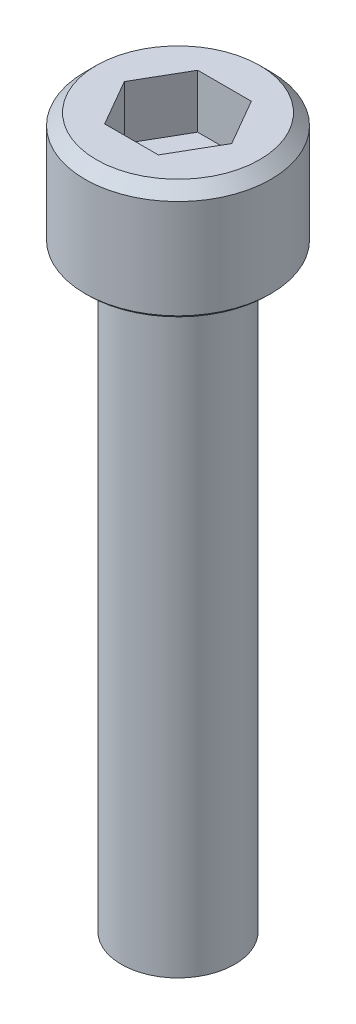
ISO-10303-21;
HEADER;
FILE_DESCRIPTION(('STEP AP214'),'2;1');
FILE_NAME('part.step','',(''),(''),'','','');
FILE_SCHEMA(('AUTOMOTIVE_DESIGN { 1 0 10303 214 1 1 1 1 }'));
ENDSEC;
DATA;
#1=APPLICATION_CONTEXT('core data for automotive mechanical design processes');
#2=APPLICATION_PROTOCOL_DEFINITION('international standard','automotive_design',2000,#1);
#3=PRODUCT_CONTEXT('',#1,'mechanical');
#4=PRODUCT('Part','Part','',(#3));
#5=PRODUCT_RELATED_PRODUCT_CATEGORY('part','',(#4));
#6=PRODUCT_DEFINITION_FORMATION('','',#4);
#7=PRODUCT_DEFINITION_CONTEXT('part definition',#1,'design');
#8=PRODUCT_DEFINITION('design','',#6,#7);
#9=PRODUCT_DEFINITION_SHAPE('','',#8);
#10=(LENGTH_UNIT() NAMED_UNIT(*) SI_UNIT(.MILLI.,.METRE.));
#11=(NAMED_UNIT(*) PLANE_ANGLE_UNIT() SI_UNIT($,.RADIAN.));
#12=(NAMED_UNIT(*) SI_UNIT($,.STERADIAN.) SOLID_ANGLE_UNIT());
#13=UNCERTAINTY_MEASURE_WITH_UNIT(LENGTH_MEASURE(1.E-05),#10,'distance_accuracy_value','');
#14=(GEOMETRIC_REPRESENTATION_CONTEXT(3) GLOBAL_UNCERTAINTY_ASSIGNED_CONTEXT((#13)) GLOBAL_UNIT_ASSIGNED_CONTEXT((#10,
#11,#12)) REPRESENTATION_CONTEXT('',''));
#15=CARTESIAN_POINT('',(0.,0.,0.));
#16=DIRECTION('',(0.,0.,1.));
#17=DIRECTION('',(1.,0.,0.));
#18=AXIS2_PLACEMENT_3D('',#15,#16,#17);
#19=CARTESIAN_POINT('',(-1.14384635331849,27.94,1.9812));
#20=DIRECTION('',(0.,-1.,0.));
#21=DIRECTION('',(0.,0.,-1.));
#22=AXIS2_PLACEMENT_3D('',#19,#20,#21);
#23=PLANE('',#22);
#24=DIRECTION('',(0.500000000000001,0.,-0.866025403784438));
#25=VECTOR('',#24,1.);
#26=CARTESIAN_POINT('',(1.14384635331849,27.94,1.9812));
#27=LINE('',#26,#25);
#28=CARTESIAN_POINT('',(1.14384635331849,27.94,1.9812));
#29=VERTEX_POINT('',#28);
#30=CARTESIAN_POINT('',(2.28769270663697,27.94,0.));
#31=VERTEX_POINT('',#30);
#32=EDGE_CURVE('E64',#29,#31,#27,.T.);
#33=ORIENTED_EDGE('',*,*,#32,.T.);
#34=DIRECTION('',(-0.5,0.,-0.866025403784439));
#35=VECTOR('',#34,1.);
#36=CARTESIAN_POINT('',(2.28769270663697,27.94,0.));
#37=LINE('',#36,#35);
#38=CARTESIAN_POINT('',(1.14384635331849,27.94,-1.9812));
#39=VERTEX_POINT('',#38);
#40=EDGE_CURVE('E102',#31,#39,#37,.T.);
#41=ORIENTED_EDGE('',*,*,#40,.T.);
#42=DIRECTION('',(-1.,0.,0.));
#43=VECTOR('',#42,1.);
#44=CARTESIAN_POINT('',(1.14384635331849,27.94,-1.9812));
#45=LINE('',#44,#43);
#46=CARTESIAN_POINT('',(-1.14384635331849,27.94,-1.9812));
#47=VERTEX_POINT('',#46);
#48=EDGE_CURVE('E98',#39,#47,#45,.T.);
#49=ORIENTED_EDGE('',*,*,#48,.T.);
#50=DIRECTION('',(-0.5,0.,0.866025403784439));
#51=VECTOR('',#50,1.);
#52=CARTESIAN_POINT('',(-1.14384635331849,27.94,-1.9812));
#53=LINE('',#52,#51);
#54=CARTESIAN_POINT('',(-2.28769270663697,27.94,0.));
#55=VERTEX_POINT('',#54);
#56=EDGE_CURVE('E81',#47,#55,#53,.T.);
#57=ORIENTED_EDGE('',*,*,#56,.T.);
#58=DIRECTION('',(0.5,0.,0.866025403784439));
#59=VECTOR('',#58,1.);
#60=CARTESIAN_POINT('',(-2.28769270663697,27.94,0.));
#61=LINE('',#60,#59);
#62=CARTESIAN_POINT('',(-1.14384635331849,27.94,1.9812));
#63=VERTEX_POINT('',#62);
#64=EDGE_CURVE('E77',#55,#63,#61,.T.);
#65=ORIENTED_EDGE('',*,*,#64,.T.);
#66=DIRECTION('',(1.,0.,0.));
#67=VECTOR('',#66,1.);
#68=CARTESIAN_POINT('',(-1.14384635331849,27.94,1.9812));
#69=LINE('',#68,#67);
#70=EDGE_CURVE('E79',#63,#29,#69,.T.);
#71=ORIENTED_EDGE('',*,*,#70,.T.);
#72=EDGE_LOOP('',(#33,#41,#49,#57,#65,#71));
#73=FACE_BOUND('',#72,.T.);
#74=ADVANCED_FACE('F18',(#73),#23,.F.);
#75=CARTESIAN_POINT('',(-1.14384635331849,27.94,1.9812));
#76=DIRECTION('',(0.,0.,1.));
#77=DIRECTION('',(1.,0.,0.));
#78=AXIS2_PLACEMENT_3D('',#75,#76,#77);
#79=PLANE('',#78);
#80=DIRECTION('',(0.,1.,0.));
#81=VECTOR('',#80,1.);
#82=CARTESIAN_POINT('',(1.14384635331849,27.94,1.9812));
#83=LINE('',#82,#81);
#84=CARTESIAN_POINT('',(1.14384635331849,30.226,1.9812));
#85=VERTEX_POINT('',#84);
#86=EDGE_CURVE('E89',#85,#29,#83,.F.);
#87=ORIENTED_EDGE('',*,*,#86,.T.);
#88=ORIENTED_EDGE('',*,*,#70,.F.);
#89=DIRECTION('',(0.,1.,0.));
#90=VECTOR('',#89,1.);
#91=CARTESIAN_POINT('',(-1.14384635331849,27.94,1.9812));
#92=LINE('',#91,#90);
#93=CARTESIAN_POINT('',(-1.14384635331849,30.226,1.9812));
#94=VERTEX_POINT('',#93);
#95=EDGE_CURVE('E85',#63,#94,#92,.T.);
#96=ORIENTED_EDGE('',*,*,#95,.T.);
#97=DIRECTION('',(1.,0.,0.));
#98=VECTOR('',#97,1.);
#99=CARTESIAN_POINT('',(3.9624,30.226,1.9812));
#100=LINE('',#99,#98);
#101=EDGE_CURVE('E57',#85,#94,#100,.F.);
#102=ORIENTED_EDGE('',*,*,#101,.F.);
#103=EDGE_LOOP('',(#87,#88,#96,#102));
#104=FACE_BOUND('',#103,.T.);
#105=ADVANCED_FACE('F87',(#104),#79,.F.);
#106=CARTESIAN_POINT('',(-2.28769270663697,27.94,0.));
#107=DIRECTION('',(-0.866025403784439,0.,0.5));
#108=DIRECTION('',(0.5,0.,0.866025403784439));
#109=AXIS2_PLACEMENT_3D('',#106,#107,#108);
#110=PLANE('',#109);
#111=ORIENTED_EDGE('',*,*,#95,.F.);
#112=ORIENTED_EDGE('',*,*,#64,.F.);
#113=DIRECTION('',(0.,1.,0.));
#114=VECTOR('',#113,1.);
#115=CARTESIAN_POINT('',(-2.28769270663697,27.94,0.));
#116=LINE('',#115,#114);
#117=CARTESIAN_POINT('',(-2.28769270663697,30.226,0.));
#118=VERTEX_POINT('',#117);
#119=EDGE_CURVE('E95',#55,#118,#116,.T.);
#120=ORIENTED_EDGE('',*,*,#119,.T.);
#121=DIRECTION('',(-0.5,0.,-0.866025403784439));
#122=VECTOR('',#121,1.);
#123=CARTESIAN_POINT('',(-1.14384635331849,30.226,1.9812));
#124=LINE('',#123,#122);
#125=EDGE_CURVE('E93',#94,#118,#124,.T.);
#126=ORIENTED_EDGE('',*,*,#125,.F.);
#127=EDGE_LOOP('',(#111,#112,#120,#126));
#128=FACE_BOUND('',#127,.T.);
#129=ADVANCED_FACE('F91',(#128),#110,.F.);
#130=CARTESIAN_POINT('',(-1.14384635331849,27.94,-1.9812));
#131=DIRECTION('',(-0.866025403784439,0.,-0.5));
#132=DIRECTION('',(-0.5,0.,0.866025403784439));
#133=AXIS2_PLACEMENT_3D('',#130,#131,#132);
#134=PLANE('',#133);
#135=ORIENTED_EDGE('',*,*,#119,.F.);
#136=ORIENTED_EDGE('',*,*,#56,.F.);
#137=DIRECTION('',(0.,1.,0.));
#138=VECTOR('',#137,1.);
#139=CARTESIAN_POINT('',(-1.14384635331849,27.94,-1.9812));
#140=LINE('',#139,#138);
#141=CARTESIAN_POINT('',(-1.14384635331849,30.226,-1.9812));
#142=VERTEX_POINT('',#141);
#143=EDGE_CURVE('E100',#47,#142,#140,.T.);
#144=ORIENTED_EDGE('',*,*,#143,.T.);
#145=DIRECTION('',(0.5,0.,-0.866025403784439));
#146=VECTOR('',#145,1.);
#147=CARTESIAN_POINT('',(-2.28769270663697,30.226,0.));
#148=LINE('',#147,#146);
#149=EDGE_CURVE('E119',#118,#142,#148,.T.);
#150=ORIENTED_EDGE('',*,*,#149,.F.);
#151=EDGE_LOOP('',(#135,#136,#144,#150));
#152=FACE_BOUND('',#151,.T.);
#153=ADVANCED_FACE('F185',(#152),#134,.F.);
#154=CARTESIAN_POINT('',(1.14384635331849,27.94,-1.9812));
#155=DIRECTION('',(0.,0.,-1.));
#156=DIRECTION('',(-1.,0.,0.));
#157=AXIS2_PLACEMENT_3D('',#154,#155,#156);
#158=PLANE('',#157);
#159=ORIENTED_EDGE('',*,*,#143,.F.);
#160=ORIENTED_EDGE('',*,*,#48,.F.);
#161=DIRECTION('',(0.,1.,0.));
#162=VECTOR('',#161,1.);
#163=CARTESIAN_POINT('',(1.14384635331849,27.94,-1.9812));
#164=LINE('',#163,#162);
#165=CARTESIAN_POINT('',(1.14384635331849,30.226,-1.9812));
#166=VERTEX_POINT('',#165);
#167=EDGE_CURVE('E104',#39,#166,#164,.T.);
#168=ORIENTED_EDGE('',*,*,#167,.T.);
#169=DIRECTION('',(1.,0.,0.));
#170=VECTOR('',#169,1.);
#171=CARTESIAN_POINT('',(3.9624,30.226,-1.9812));
#172=LINE('',#171,#170);
#173=EDGE_CURVE('E116',#142,#166,#172,.T.);
#174=ORIENTED_EDGE('',*,*,#173,.F.);
#175=EDGE_LOOP('',(#159,#160,#168,#174));
#176=FACE_BOUND('',#175,.T.);
#177=ADVANCED_FACE('F181',(#176),#158,.F.);
#178=CARTESIAN_POINT('',(2.28769270663697,27.94,0.));
#179=DIRECTION('',(0.866025403784439,0.,-0.5));
#180=DIRECTION('',(-0.5,0.,-0.866025403784439));
#181=AXIS2_PLACEMENT_3D('',#178,#179,#180);
#182=PLANE('',#181);
#183=ORIENTED_EDGE('',*,*,#167,.F.);
#184=ORIENTED_EDGE('',*,*,#40,.F.);
#185=DIRECTION('',(0.,1.,0.));
#186=VECTOR('',#185,1.);
#187=CARTESIAN_POINT('',(2.28769270663697,27.94,0.));
#188=LINE('',#187,#186);
#189=CARTESIAN_POINT('',(2.28769270663697,30.226,0.));
#190=VERTEX_POINT('',#189);
#191=EDGE_CURVE('E37',#31,#190,#188,.T.);
#192=ORIENTED_EDGE('',*,*,#191,.T.);
#193=DIRECTION('',(0.5,0.,0.866025403784439));
#194=VECTOR('',#193,1.);
#195=CARTESIAN_POINT('',(1.14384635331849,30.226,-1.9812));
#196=LINE('',#195,#194);
#197=EDGE_CURVE('E113',#166,#190,#196,.T.);
#198=ORIENTED_EDGE('',*,*,#197,.F.);
#199=EDGE_LOOP('',(#183,#184,#192,#198));
#200=FACE_BOUND('',#199,.T.);
#201=ADVANCED_FACE('F176',(#200),#182,.F.);
#202=CARTESIAN_POINT('',(1.14384635331849,27.94,1.9812));
#203=DIRECTION('',(0.866025403784438,0.,0.500000000000001));
#204=DIRECTION('',(0.500000000000001,0.,-0.866025403784438));
#205=AXIS2_PLACEMENT_3D('',#202,#203,#204);
#206=PLANE('',#205);
#207=ORIENTED_EDGE('',*,*,#191,.F.);
#208=ORIENTED_EDGE('',*,*,#32,.F.);
#209=ORIENTED_EDGE('',*,*,#86,.F.);
#210=DIRECTION('',(-0.5,0.,0.866025403784438));
#211=VECTOR('',#210,1.);
#212=CARTESIAN_POINT('',(2.28769270663697,30.226,0.));
#213=LINE('',#212,#211);
#214=EDGE_CURVE('E110',#190,#85,#213,.T.);
#215=ORIENTED_EDGE('',*,*,#214,.F.);
#216=EDGE_LOOP('',(#207,#208,#209,#215));
#217=FACE_BOUND('',#216,.T.);
#218=ADVANCED_FACE('F171',(#217),#206,.F.);
#219=CARTESIAN_POINT('',(3.9624,30.226,0.));
#220=DIRECTION('',(0.,1.,0.));
#221=DIRECTION('',(0.,0.,1.));
#222=AXIS2_PLACEMENT_3D('',#219,#220,#221);
#223=PLANE('',#222);
#224=ORIENTED_EDGE('',*,*,#197,.T.);
#225=ORIENTED_EDGE('',*,*,#214,.T.);
#226=ORIENTED_EDGE('',*,*,#101,.T.);
#227=ORIENTED_EDGE('',*,*,#125,.T.);
#228=ORIENTED_EDGE('',*,*,#149,.T.);
#229=ORIENTED_EDGE('',*,*,#173,.T.);
#230=EDGE_LOOP('',(#224,#225,#226,#227,#228,#229));
#231=FACE_BOUND('',#230,.T.);
#232=CARTESIAN_POINT('',(0.,30.2259999999706,0.));
#233=DIRECTION('',(0.,-1.,0.));
#234=DIRECTION('',(0.,0.,-1.));
#235=AXIS2_PLACEMENT_3D('',#232,#233,#234);
#236=CIRCLE('',#235,3.4797999999796);
#237=CARTESIAN_POINT('',(0.,30.2259999999706,-3.4797999999796));
#238=VERTEX_POINT('',#237);
#239=EDGE_CURVE('E22',#238,#238,#236,.T.);
#240=ORIENTED_EDGE('',*,*,#239,.F.);
#241=EDGE_LOOP('',(#240));
#242=FACE_BOUND('',#241,.T.);
#243=ADVANCED_FACE('F166',(#231,#242),#223,.T.);
#244=CARTESIAN_POINT('',(0.,29.7434000000862,0.));
#245=DIRECTION('',(0.,-1.,0.));
#246=DIRECTION('',(0.,0.,-1.));
#247=AXIS2_PLACEMENT_3D('',#244,#245,#246);
#248=CONICAL_SURFACE('',#247,3.96239999986392,0.785398163397448);
#249=CARTESIAN_POINT('',(0.,29.7434,0.));
#250=DIRECTION('',(0.,-1.,0.));
#251=DIRECTION('',(0.,0.,-1.));
#252=AXIS2_PLACEMENT_3D('',#249,#250,#251);
#253=CIRCLE('',#252,3.9624);
#254=CARTESIAN_POINT('',(0.,29.7434,-3.9624));
#255=VERTEX_POINT('',#254);
#256=EDGE_CURVE('E128',#255,#255,#253,.T.);
#257=ORIENTED_EDGE('',*,*,#256,.F.);
#258=EDGE_LOOP('',(#257));
#259=FACE_BOUND('',#258,.T.);
#260=ORIENTED_EDGE('',*,*,#239,.T.);
#261=EDGE_LOOP('',(#260));
#262=FACE_BOUND('',#261,.T.);
#263=ADVANCED_FACE('F149',(#259,#262),#248,.T.);
#264=CARTESIAN_POINT('',(0.,0.,0.));
#265=DIRECTION('',(0.,-1.,0.));
#266=DIRECTION('',(0.,0.,-1.));
#267=AXIS2_PLACEMENT_3D('',#264,#265,#266);
#268=CYLINDRICAL_SURFACE('',#267,3.9624);
#269=CARTESIAN_POINT('',(0.,25.527000000011,0.));
#270=DIRECTION('',(0.,1.,0.));
#271=DIRECTION('',(0.,0.,1.));
#272=AXIS2_PLACEMENT_3D('',#269,#270,#271);
#273=CIRCLE('',#272,3.96240000003445);
#274=CARTESIAN_POINT('',(0.,25.527000000011,3.96240000003445));
#275=VERTEX_POINT('',#274);
#276=EDGE_CURVE('E124',#275,#275,#273,.F.);
#277=ORIENTED_EDGE('',*,*,#276,.F.);
#278=EDGE_LOOP('',(#277));
#279=FACE_BOUND('',#278,.T.);
#280=ORIENTED_EDGE('',*,*,#256,.T.);
#281=EDGE_LOOP('',(#280));
#282=FACE_BOUND('',#281,.T.);
#283=ADVANCED_FACE('F139',(#279,#282),#268,.T.);
#284=CARTESIAN_POINT('',(0.,25.527000000011,0.));
#285=DIRECTION('',(0.,1.,0.));
#286=DIRECTION('',(0.,0.,1.));
#287=AXIS2_PLACEMENT_3D('',#284,#285,#286);
#288=CONICAL_SURFACE('',#287,3.96240000003445,0.785398163173655);
#289=ORIENTED_EDGE('',*,*,#276,.T.);
#290=EDGE_LOOP('',(#289));
#291=FACE_BOUND('',#290,.T.);
#292=CARTESIAN_POINT('',(0.,25.3999999999905,0.));
#293=DIRECTION('',(0.,1.,0.));
#294=DIRECTION('',(0.,0.,1.));
#295=AXIS2_PLACEMENT_3D('',#292,#293,#294);
#296=CIRCLE('',#295,3.83540000007088);
#297=CARTESIAN_POINT('',(0.,25.3999999999905,3.83540000007088));
#298=VERTEX_POINT('',#297);
#299=EDGE_CURVE('E127',#298,#298,#296,.F.);
#300=ORIENTED_EDGE('',*,*,#299,.F.);
#301=EDGE_LOOP('',(#300));
#302=FACE_BOUND('',#301,.T.);
#303=ADVANCED_FACE('F137',(#291,#302),#288,.T.);
#304=CARTESIAN_POINT('',(2.413,25.4,0.));
#305=DIRECTION('',(0.,-1.,0.));
#306=DIRECTION('',(0.,0.,-1.));
#307=AXIS2_PLACEMENT_3D('',#304,#305,#306);
#308=PLANE('',#307);
#309=CARTESIAN_POINT('',(0.,25.4,0.));
#310=DIRECTION('',(0.,-1.,0.));
#311=DIRECTION('',(0.,0.,-1.));
#312=AXIS2_PLACEMENT_3D('',#309,#310,#311);
#313=CIRCLE('',#312,2.413);
#314=CARTESIAN_POINT('',(0.,25.4,-2.413));
#315=VERTEX_POINT('',#314);
#316=EDGE_CURVE('E28',#315,#315,#313,.T.);
#317=ORIENTED_EDGE('',*,*,#316,.F.);
#318=EDGE_LOOP('',(#317));
#319=FACE_BOUND('',#318,.T.);
#320=ORIENTED_EDGE('',*,*,#299,.T.);
#321=EDGE_LOOP('',(#320));
#322=FACE_BOUND('',#321,.T.);
#323=ADVANCED_FACE('F135',(#319,#322),#308,.T.);
#324=CARTESIAN_POINT('',(0.,0.,0.));
#325=DIRECTION('',(0.,-1.,0.));
#326=DIRECTION('',(0.,0.,-1.));
#327=AXIS2_PLACEMENT_3D('',#324,#325,#326);
#328=PLANE('',#327);
#329=CARTESIAN_POINT('',(0.,0.,0.));
#330=DIRECTION('',(0.,-1.,0.));
#331=DIRECTION('',(0.,0.,-1.));
#332=AXIS2_PLACEMENT_3D('',#329,#330,#331);
#333=CIRCLE('',#332,2.413);
#334=CARTESIAN_POINT('',(0.,0.,-2.413));
#335=VERTEX_POINT('',#334);
#336=EDGE_CURVE('E10',#335,#335,#333,.F.);
#337=ORIENTED_EDGE('',*,*,#336,.F.);
#338=EDGE_LOOP('',(#337));
#339=FACE_BOUND('',#338,.T.);
#340=ADVANCED_FACE('F145',(#339),#328,.T.);
#341=CARTESIAN_POINT('',(0.,0.,0.));
#342=DIRECTION('',(0.,-1.,0.));
#343=DIRECTION('',(0.,0.,-1.));
#344=AXIS2_PLACEMENT_3D('',#341,#342,#343);
#345=CYLINDRICAL_SURFACE('',#344,2.413);
#346=ORIENTED_EDGE('',*,*,#336,.T.);
#347=EDGE_LOOP('',(#346));
#348=FACE_BOUND('',#347,.T.);
#349=ORIENTED_EDGE('',*,*,#316,.T.);
#350=EDGE_LOOP('',(#349));
#351=FACE_BOUND('',#350,.T.);
#352=ADVANCED_FACE('F20',(#348,#351),#345,.T.);
#353=CLOSED_SHELL('',(#74,#105,#129,#153,#177,#201,#218,#243,#263,#283,#303,#323,#340,#352));
#354=MANIFOLD_SOLID_BREP('B1',#353);
#355=ADVANCED_BREP_SHAPE_REPRESENTATION('',(#18,#354),#14);
#356=SHAPE_DEFINITION_REPRESENTATION(#9,#355);
ENDSEC;
END-ISO-10303-21;
